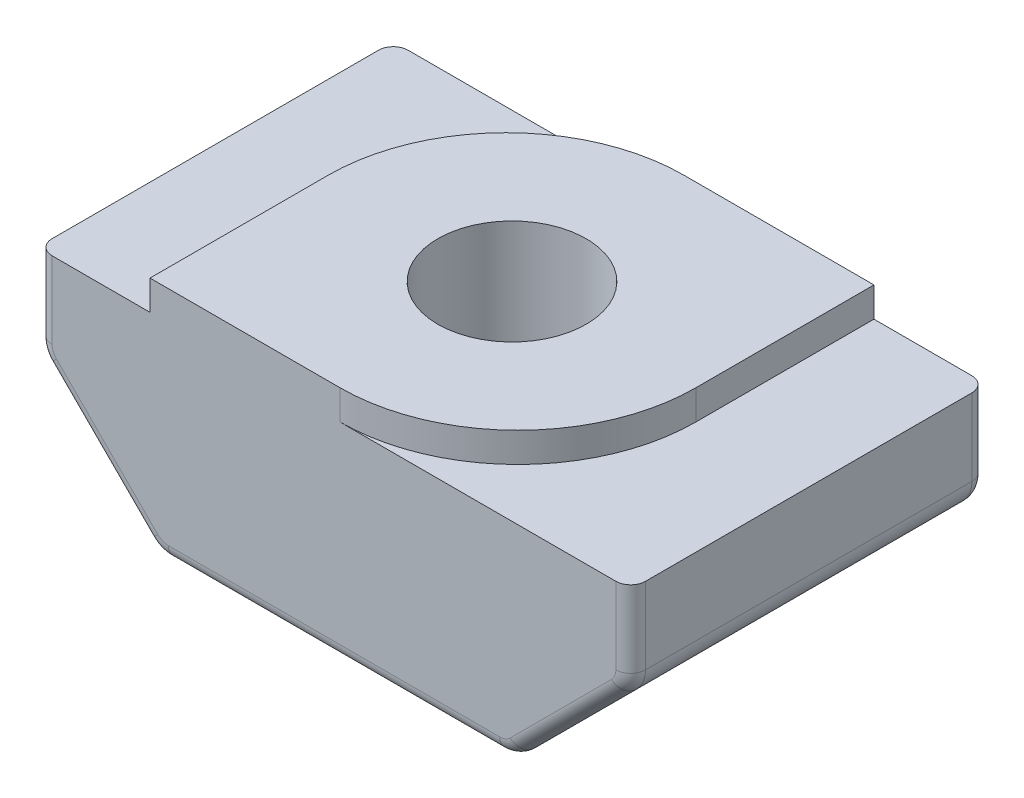
ISO-10303-21;
HEADER;
FILE_DESCRIPTION(('STEP AP214'),'2;1');
FILE_NAME('part.step','',(''),(''),'','','');
FILE_SCHEMA(('AUTOMOTIVE_DESIGN { 1 0 10303 214 1 1 1 1 }'));
ENDSEC;
DATA;
#1=APPLICATION_CONTEXT('core data for automotive mechanical design processes');
#2=APPLICATION_PROTOCOL_DEFINITION('international standard','automotive_design',2000,#1);
#3=PRODUCT_CONTEXT('',#1,'mechanical');
#4=PRODUCT('Part','Part','',(#3));
#5=PRODUCT_RELATED_PRODUCT_CATEGORY('part','',(#4));
#6=PRODUCT_DEFINITION_FORMATION('','',#4);
#7=PRODUCT_DEFINITION_CONTEXT('part definition',#1,'design');
#8=PRODUCT_DEFINITION('design','',#6,#7);
#9=PRODUCT_DEFINITION_SHAPE('','',#8);
#10=(LENGTH_UNIT() NAMED_UNIT(*) SI_UNIT(.MILLI.,.METRE.));
#11=(NAMED_UNIT(*) PLANE_ANGLE_UNIT() SI_UNIT($,.RADIAN.));
#12=(NAMED_UNIT(*) SI_UNIT($,.STERADIAN.) SOLID_ANGLE_UNIT());
#13=UNCERTAINTY_MEASURE_WITH_UNIT(LENGTH_MEASURE(1.E-05),#10,'distance_accuracy_value','');
#14=(GEOMETRIC_REPRESENTATION_CONTEXT(3) GLOBAL_UNCERTAINTY_ASSIGNED_CONTEXT((#13)) GLOBAL_UNIT_ASSIGNED_CONTEXT((#10,
#11,#12)) REPRESENTATION_CONTEXT('',''));
#15=CARTESIAN_POINT('',(0.,0.,0.));
#16=DIRECTION('',(0.,0.,1.));
#17=DIRECTION('',(1.,0.,0.));
#18=AXIS2_PLACEMENT_3D('',#15,#16,#17);
#19=CARTESIAN_POINT('',(-3.1,0.,6.));
#20=DIRECTION('',(1.,0.,0.));
#21=DIRECTION('',(0.,0.,-1.));
#22=AXIS2_PLACEMENT_3D('',#19,#20,#21);
#23=PLANE('',#22);
#24=DIRECTION('',(0.,0.,-1.));
#25=VECTOR('',#24,1.);
#26=CARTESIAN_POINT('',(-3.1,0.,6.));
#27=LINE('',#26,#25);
#28=CARTESIAN_POINT('',(-3.1,0.,6.));
#29=VERTEX_POINT('',#28);
#30=CARTESIAN_POINT('',(-3.1,0.,3.));
#31=VERTEX_POINT('',#30);
#32=EDGE_CURVE('E426',#29,#31,#27,.T.);
#33=ORIENTED_EDGE('',*,*,#32,.T.);
#34=DIRECTION('',(0.,-1.,0.));
#35=VECTOR('',#34,1.);
#36=CARTESIAN_POINT('',(-3.1,-0.500000000000001,3.));
#37=LINE('',#36,#35);
#38=CARTESIAN_POINT('',(-3.1,-0.500000000000001,3.));
#39=VERTEX_POINT('',#38);
#40=EDGE_CURVE('E238',#31,#39,#37,.T.);
#41=ORIENTED_EDGE('',*,*,#40,.T.);
#42=DIRECTION('',(0.,0.,-1.));
#43=VECTOR('',#42,1.);
#44=CARTESIAN_POINT('',(-3.1,-0.500000000000001,6.));
#45=LINE('',#44,#43);
#46=CARTESIAN_POINT('',(-3.1,-0.500000000000001,6.));
#47=VERTEX_POINT('',#46);
#48=EDGE_CURVE('E219',#47,#39,#45,.T.);
#49=ORIENTED_EDGE('',*,*,#48,.F.);
#50=DIRECTION('',(0.,-1.,0.));
#51=VECTOR('',#50,1.);
#52=CARTESIAN_POINT('',(-3.1,0.,6.));
#53=LINE('',#52,#51);
#54=EDGE_CURVE('E224',#29,#47,#53,.T.);
#55=ORIENTED_EDGE('',*,*,#54,.F.);
#56=EDGE_LOOP('',(#33,#41,#49,#55));
#57=FACE_BOUND('',#56,.T.);
#58=ADVANCED_FACE('F37',(#57),#23,.F.);
#59=CARTESIAN_POINT('',(-3.1,-0.500000000000001,6.));
#60=DIRECTION('',(0.,-1.,0.));
#61=DIRECTION('',(1.,0.,0.));
#62=AXIS2_PLACEMENT_3D('',#59,#60,#61);
#63=PLANE('',#62);
#64=DIRECTION('',(-1.,0.,0.));
#65=VECTOR('',#64,1.);
#66=CARTESIAN_POINT('',(-3.1,-0.500000000000001,0.));
#67=LINE('',#66,#65);
#68=CARTESIAN_POINT('',(-0.0999999999999998,-0.500000000000001,0.));
#69=VERTEX_POINT('',#68);
#70=CARTESIAN_POINT('',(-4.75,-0.500000000000001,0.));
#71=VERTEX_POINT('',#70);
#72=EDGE_CURVE('E429',#69,#71,#67,.T.);
#73=ORIENTED_EDGE('',*,*,#72,.T.);
#74=CARTESIAN_POINT('',(-4.75,-0.500000000000001,0.25));
#75=DIRECTION('',(0.,-1.,0.));
#76=DIRECTION('',(1.,0.,0.));
#77=AXIS2_PLACEMENT_3D('',#74,#75,#76);
#78=CIRCLE('',#77,0.25);
#79=CARTESIAN_POINT('',(-5.,-0.500000000000001,0.25));
#80=VERTEX_POINT('',#79);
#81=EDGE_CURVE('E310',#71,#80,#78,.F.);
#82=ORIENTED_EDGE('',*,*,#81,.T.);
#83=DIRECTION('',(0.,0.,-1.));
#84=VECTOR('',#83,1.);
#85=CARTESIAN_POINT('',(-5.,-0.500000000000001,6.));
#86=LINE('',#85,#84);
#87=CARTESIAN_POINT('',(-5.,-0.500000000000001,5.75));
#88=VERTEX_POINT('',#87);
#89=EDGE_CURVE('E239',#88,#80,#86,.T.);
#90=ORIENTED_EDGE('',*,*,#89,.F.);
#91=CARTESIAN_POINT('',(-4.75,-0.500000000000001,5.75));
#92=DIRECTION('',(0.,-1.,0.));
#93=DIRECTION('',(1.,0.,0.));
#94=AXIS2_PLACEMENT_3D('',#91,#92,#93);
#95=CIRCLE('',#94,0.25);
#96=CARTESIAN_POINT('',(-4.75,-0.500000000000001,6.));
#97=VERTEX_POINT('',#96);
#98=EDGE_CURVE('E222',#88,#97,#95,.F.);
#99=ORIENTED_EDGE('',*,*,#98,.T.);
#100=DIRECTION('',(-1.,0.,0.));
#101=VECTOR('',#100,1.);
#102=CARTESIAN_POINT('',(-3.1,-0.500000000000001,6.));
#103=LINE('',#102,#101);
#104=EDGE_CURVE('E213',#47,#97,#103,.T.);
#105=ORIENTED_EDGE('',*,*,#104,.F.);
#106=ORIENTED_EDGE('',*,*,#48,.T.);
#107=CARTESIAN_POINT('',(-0.0999999999999998,-0.500000000000001,3.));
#108=DIRECTION('',(0.,-1.,0.));
#109=DIRECTION('',(1.,0.,0.));
#110=AXIS2_PLACEMENT_3D('',#107,#108,#109);
#111=CIRCLE('',#110,3.);
#112=EDGE_CURVE('E257',#39,#69,#111,.T.);
#113=ORIENTED_EDGE('',*,*,#112,.T.);
#114=EDGE_LOOP('',(#73,#82,#90,#99,#105,#106,#113));
#115=FACE_BOUND('',#114,.T.);
#116=ADVANCED_FACE('F216',(#115),#63,.F.);
#117=CARTESIAN_POINT('',(-5.,-0.500000000000001,6.));
#118=DIRECTION('',(1.,0.,0.));
#119=DIRECTION('',(0.,0.,-1.));
#120=AXIS2_PLACEMENT_3D('',#117,#118,#119);
#121=PLANE('',#120);
#122=ORIENTED_EDGE('',*,*,#89,.T.);
#123=DIRECTION('',(0.,-1.,0.));
#124=VECTOR('',#123,1.);
#125=CARTESIAN_POINT('',(-5.,-1.79289321881345,0.25));
#126=LINE('',#125,#124);
#127=CARTESIAN_POINT('',(-5.,-1.79289321881345,0.25));
#128=VERTEX_POINT('',#127);
#129=EDGE_CURVE('E288',#80,#128,#126,.T.);
#130=ORIENTED_EDGE('',*,*,#129,.T.);
#131=DIRECTION('',(0.,0.,-1.));
#132=VECTOR('',#131,1.);
#133=CARTESIAN_POINT('',(-5.,-1.79289321881345,6.));
#134=LINE('',#133,#132);
#135=CARTESIAN_POINT('',(-5.,-1.79289321881345,5.75));
#136=VERTEX_POINT('',#135);
#137=EDGE_CURVE('E283',#128,#136,#134,.F.);
#138=ORIENTED_EDGE('',*,*,#137,.T.);
#139=DIRECTION('',(0.,-1.,0.));
#140=VECTOR('',#139,1.);
#141=CARTESIAN_POINT('',(-5.,-0.500000000000001,5.75));
#142=LINE('',#141,#140);
#143=EDGE_CURVE('E286',#136,#88,#142,.F.);
#144=ORIENTED_EDGE('',*,*,#143,.T.);
#145=EDGE_LOOP('',(#122,#130,#138,#144));
#146=FACE_BOUND('',#145,.T.);
#147=ADVANCED_FACE('F479',(#146),#121,.F.);
#148=CARTESIAN_POINT('',(-5.,-2.,6.));
#149=DIRECTION('',(0.707106781186546,0.707106781186549,0.));
#150=DIRECTION('',(-0.707106781186549,0.707106781186546,0.));
#151=AXIS2_PLACEMENT_3D('',#148,#149,#150);
#152=PLANE('',#151);
#153=DIRECTION('',(0.,0.,-1.));
#154=VECTOR('',#153,1.);
#155=CARTESIAN_POINT('',(-4.85355339059327,-2.14644660940673,6.));
#156=LINE('',#155,#154);
#157=CARTESIAN_POINT('',(-4.85355339059327,-2.14644660940673,5.75));
#158=VERTEX_POINT('',#157);
#159=CARTESIAN_POINT('',(-4.85355339059327,-2.14644660940673,0.25));
#160=VERTEX_POINT('',#159);
#161=EDGE_CURVE('E280',#158,#160,#156,.T.);
#162=ORIENTED_EDGE('',*,*,#161,.T.);
#163=DIRECTION('',(0.707106781186549,-0.707106781186546,0.));
#164=VECTOR('',#163,1.);
#165=CARTESIAN_POINT('',(-3.14644660940672,-3.85355339059328,0.25));
#166=LINE('',#165,#164);
#167=CARTESIAN_POINT('',(-3.14644660940672,-3.85355339059328,0.25));
#168=VERTEX_POINT('',#167);
#169=EDGE_CURVE('E318',#160,#168,#166,.T.);
#170=ORIENTED_EDGE('',*,*,#169,.T.);
#171=DIRECTION('',(0.,0.,-1.));
#172=VECTOR('',#171,1.);
#173=CARTESIAN_POINT('',(-3.14644660940672,-3.85355339059328,6.));
#174=LINE('',#173,#172);
#175=CARTESIAN_POINT('',(-3.14644660940672,-3.85355339059328,5.75));
#176=VERTEX_POINT('',#175);
#177=EDGE_CURVE('E277',#168,#176,#174,.F.);
#178=ORIENTED_EDGE('',*,*,#177,.T.);
#179=DIRECTION('',(0.707106781186549,-0.707106781186546,0.));
#180=VECTOR('',#179,1.);
#181=CARTESIAN_POINT('',(-5.,-2.,5.75));
#182=LINE('',#181,#180);
#183=EDGE_CURVE('E316',#176,#158,#182,.F.);
#184=ORIENTED_EDGE('',*,*,#183,.T.);
#185=EDGE_LOOP('',(#162,#170,#178,#184));
#186=FACE_BOUND('',#185,.T.);
#187=ADVANCED_FACE('F796',(#186),#152,.F.);
#188=CARTESIAN_POINT('',(-2.99999999999999,-4.,6.));
#189=DIRECTION('',(0.,1.,0.));
#190=DIRECTION('',(0.,0.,1.));
#191=AXIS2_PLACEMENT_3D('',#188,#189,#190);
#192=PLANE('',#191);
#193=CARTESIAN_POINT('',(0.,-4.,3.));
#194=DIRECTION('',(0.,1.,0.));
#195=DIRECTION('',(0.,0.,1.));
#196=AXIS2_PLACEMENT_3D('',#193,#194,#195);
#197=CIRCLE('',#196,1.25);
#198=CARTESIAN_POINT('',(0.,-4.,4.25));
#199=VERTEX_POINT('',#198);
#200=EDGE_CURVE('E432',#199,#199,#197,.T.);
#201=ORIENTED_EDGE('',*,*,#200,.T.);
#202=EDGE_LOOP('',(#201));
#203=FACE_BOUND('',#202,.T.);
#204=DIRECTION('',(0.,0.,-1.));
#205=VECTOR('',#204,1.);
#206=CARTESIAN_POINT('',(-2.79289321881344,-4.,6.));
#207=LINE('',#206,#205);
#208=CARTESIAN_POINT('',(-2.79289321881344,-4.,5.75));
#209=VERTEX_POINT('',#208);
#210=CARTESIAN_POINT('',(-2.79289321881344,-4.,0.25));
#211=VERTEX_POINT('',#210);
#212=EDGE_CURVE('E271',#209,#211,#207,.T.);
#213=ORIENTED_EDGE('',*,*,#212,.T.);
#214=DIRECTION('',(1.,0.,0.));
#215=VECTOR('',#214,1.);
#216=CARTESIAN_POINT('',(2.79289321881344,-4.,0.25));
#217=LINE('',#216,#215);
#218=CARTESIAN_POINT('',(2.79289321881344,-4.,0.25));
#219=VERTEX_POINT('',#218);
#220=EDGE_CURVE('E11',#211,#219,#217,.T.);
#221=ORIENTED_EDGE('',*,*,#220,.T.);
#222=DIRECTION('',(0.,0.,-1.));
#223=VECTOR('',#222,1.);
#224=CARTESIAN_POINT('',(2.79289321881344,-4.,6.));
#225=LINE('',#224,#223);
#226=CARTESIAN_POINT('',(2.79289321881344,-4.,5.75));
#227=VERTEX_POINT('',#226);
#228=EDGE_CURVE('E274',#219,#227,#225,.F.);
#229=ORIENTED_EDGE('',*,*,#228,.T.);
#230=DIRECTION('',(1.,0.,0.));
#231=VECTOR('',#230,1.);
#232=CARTESIAN_POINT('',(-2.99999999999999,-4.,5.75));
#233=LINE('',#232,#231);
#234=EDGE_CURVE('E46',#227,#209,#233,.F.);
#235=ORIENTED_EDGE('',*,*,#234,.T.);
#236=EDGE_LOOP('',(#213,#221,#229,#235));
#237=FACE_BOUND('',#236,.T.);
#238=ADVANCED_FACE('F787',(#203,#237),#192,.F.);
#239=CARTESIAN_POINT('',(5.,-2.,6.));
#240=DIRECTION('',(-0.707106781186546,0.707106781186549,0.));
#241=DIRECTION('',(-0.707106781186549,-0.707106781186546,0.));
#242=AXIS2_PLACEMENT_3D('',#239,#240,#241);
#243=PLANE('',#242);
#244=DIRECTION('',(0.,0.,-1.));
#245=VECTOR('',#244,1.);
#246=CARTESIAN_POINT('',(3.14644660940672,-3.85355339059328,6.));
#247=LINE('',#246,#245);
#248=CARTESIAN_POINT('',(3.14644660940672,-3.85355339059328,5.75));
#249=VERTEX_POINT('',#248);
#250=CARTESIAN_POINT('',(3.14644660940672,-3.85355339059328,0.25));
#251=VERTEX_POINT('',#250);
#252=EDGE_CURVE('E265',#249,#251,#247,.T.);
#253=ORIENTED_EDGE('',*,*,#252,.T.);
#254=DIRECTION('',(0.707106781186549,0.707106781186546,0.));
#255=VECTOR('',#254,1.);
#256=CARTESIAN_POINT('',(4.85355339059327,-2.14644660940673,0.25));
#257=LINE('',#256,#255);
#258=CARTESIAN_POINT('',(4.85355339059327,-2.14644660940673,0.25));
#259=VERTEX_POINT('',#258);
#260=EDGE_CURVE('E338',#251,#259,#257,.T.);
#261=ORIENTED_EDGE('',*,*,#260,.T.);
#262=DIRECTION('',(0.,0.,-1.));
#263=VECTOR('',#262,1.);
#264=CARTESIAN_POINT('',(4.85355339059327,-2.14644660940673,6.));
#265=LINE('',#264,#263);
#266=CARTESIAN_POINT('',(4.85355339059327,-2.14644660940673,5.75));
#267=VERTEX_POINT('',#266);
#268=EDGE_CURVE('E268',#259,#267,#265,.F.);
#269=ORIENTED_EDGE('',*,*,#268,.T.);
#270=DIRECTION('',(0.707106781186549,0.707106781186546,0.));
#271=VECTOR('',#270,1.);
#272=CARTESIAN_POINT('',(5.,-2.,5.75));
#273=LINE('',#272,#271);
#274=EDGE_CURVE('E336',#267,#249,#273,.F.);
#275=ORIENTED_EDGE('',*,*,#274,.T.);
#276=EDGE_LOOP('',(#253,#261,#269,#275));
#277=FACE_BOUND('',#276,.T.);
#278=ADVANCED_FACE('F779',(#277),#243,.F.);
#279=CARTESIAN_POINT('',(5.,-0.500000000000001,6.));
#280=DIRECTION('',(-1.,0.,0.));
#281=DIRECTION('',(0.,0.,1.));
#282=AXIS2_PLACEMENT_3D('',#279,#280,#281);
#283=PLANE('',#282);
#284=DIRECTION('',(0.,0.,-1.));
#285=VECTOR('',#284,1.);
#286=CARTESIAN_POINT('',(5.,-1.79289321881345,6.));
#287=LINE('',#286,#285);
#288=CARTESIAN_POINT('',(5.,-1.79289321881345,5.75));
#289=VERTEX_POINT('',#288);
#290=CARTESIAN_POINT('',(5.,-1.79289321881345,0.25));
#291=VERTEX_POINT('',#290);
#292=EDGE_CURVE('E262',#289,#291,#287,.T.);
#293=ORIENTED_EDGE('',*,*,#292,.T.);
#294=DIRECTION('',(0.,1.,0.));
#295=VECTOR('',#294,1.);
#296=CARTESIAN_POINT('',(5.,-0.500000000000001,0.25));
#297=LINE('',#296,#295);
#298=CARTESIAN_POINT('',(5.,-0.500000000000001,0.25));
#299=VERTEX_POINT('',#298);
#300=EDGE_CURVE('E326',#291,#299,#297,.T.);
#301=ORIENTED_EDGE('',*,*,#300,.T.);
#302=DIRECTION('',(0.,0.,-1.));
#303=VECTOR('',#302,1.);
#304=CARTESIAN_POINT('',(5.,-0.500000000000001,6.));
#305=LINE('',#304,#303);
#306=CARTESIAN_POINT('',(5.,-0.500000000000001,5.75));
#307=VERTEX_POINT('',#306);
#308=EDGE_CURVE('E244',#307,#299,#305,.T.);
#309=ORIENTED_EDGE('',*,*,#308,.F.);
#310=DIRECTION('',(0.,1.,0.));
#311=VECTOR('',#310,1.);
#312=CARTESIAN_POINT('',(5.,-0.500000000000001,5.75));
#313=LINE('',#312,#311);
#314=EDGE_CURVE('E324',#307,#289,#313,.F.);
#315=ORIENTED_EDGE('',*,*,#314,.T.);
#316=EDGE_LOOP('',(#293,#301,#309,#315));
#317=FACE_BOUND('',#316,.T.);
#318=ADVANCED_FACE('F771',(#317),#283,.F.);
#319=CARTESIAN_POINT('',(3.1,-0.500000000000001,6.));
#320=DIRECTION('',(0.,-1.,0.));
#321=DIRECTION('',(1.,0.,0.));
#322=AXIS2_PLACEMENT_3D('',#319,#320,#321);
#323=PLANE('',#322);
#324=ORIENTED_EDGE('',*,*,#308,.T.);
#325=CARTESIAN_POINT('',(4.75,-0.500000000000001,0.25));
#326=DIRECTION('',(0.,-1.,0.));
#327=DIRECTION('',(1.,0.,0.));
#328=AXIS2_PLACEMENT_3D('',#325,#326,#327);
#329=CIRCLE('',#328,0.25);
#330=CARTESIAN_POINT('',(4.75,-0.500000000000001,0.));
#331=VERTEX_POINT('',#330);
#332=EDGE_CURVE('E330',#299,#331,#329,.F.);
#333=ORIENTED_EDGE('',*,*,#332,.T.);
#334=DIRECTION('',(-1.,0.,0.));
#335=VECTOR('',#334,1.);
#336=CARTESIAN_POINT('',(3.1,-0.500000000000001,0.));
#337=LINE('',#336,#335);
#338=CARTESIAN_POINT('',(3.1,-0.500000000000001,0.));
#339=VERTEX_POINT('',#338);
#340=EDGE_CURVE('E431',#331,#339,#337,.T.);
#341=ORIENTED_EDGE('',*,*,#340,.T.);
#342=DIRECTION('',(0.,0.,-1.));
#343=VECTOR('',#342,1.);
#344=CARTESIAN_POINT('',(3.1,-0.500000000000001,6.));
#345=LINE('',#344,#343);
#346=CARTESIAN_POINT('',(3.1,-0.500000000000001,3.));
#347=VERTEX_POINT('',#346);
#348=EDGE_CURVE('E442',#347,#339,#345,.T.);
#349=ORIENTED_EDGE('',*,*,#348,.F.);
#350=CARTESIAN_POINT('',(0.0999999999999998,-0.500000000000001,3.));
#351=DIRECTION('',(0.,-1.,0.));
#352=DIRECTION('',(1.,0.,0.));
#353=AXIS2_PLACEMENT_3D('',#350,#351,#352);
#354=CIRCLE('',#353,3.);
#355=CARTESIAN_POINT('',(0.0999999999999998,-0.500000000000001,6.));
#356=VERTEX_POINT('',#355);
#357=EDGE_CURVE('E259',#347,#356,#354,.T.);
#358=ORIENTED_EDGE('',*,*,#357,.T.);
#359=DIRECTION('',(-1.,0.,0.));
#360=VECTOR('',#359,1.);
#361=CARTESIAN_POINT('',(3.1,-0.500000000000001,6.));
#362=LINE('',#361,#360);
#363=CARTESIAN_POINT('',(4.75,-0.500000000000001,6.));
#364=VERTEX_POINT('',#363);
#365=EDGE_CURVE('E223',#364,#356,#362,.T.);
#366=ORIENTED_EDGE('',*,*,#365,.F.);
#367=CARTESIAN_POINT('',(4.75,-0.500000000000001,5.75));
#368=DIRECTION('',(0.,-1.,0.));
#369=DIRECTION('',(1.,0.,0.));
#370=AXIS2_PLACEMENT_3D('',#367,#368,#369);
#371=CIRCLE('',#370,0.25);
#372=EDGE_CURVE('E328',#364,#307,#371,.F.);
#373=ORIENTED_EDGE('',*,*,#372,.T.);
#374=EDGE_LOOP('',(#324,#333,#341,#349,#358,#366,#373));
#375=FACE_BOUND('',#374,.T.);
#376=ADVANCED_FACE('F420',(#375),#323,.F.);
#377=CARTESIAN_POINT('',(3.1,0.,6.));
#378=DIRECTION('',(-1.,0.,0.));
#379=DIRECTION('',(0.,0.,1.));
#380=AXIS2_PLACEMENT_3D('',#377,#378,#379);
#381=PLANE('',#380);
#382=DIRECTION('',(0.,0.,-1.));
#383=VECTOR('',#382,1.);
#384=CARTESIAN_POINT('',(3.1,0.,6.));
#385=LINE('',#384,#383);
#386=CARTESIAN_POINT('',(3.1,0.,3.));
#387=VERTEX_POINT('',#386);
#388=CARTESIAN_POINT('',(3.1,0.,0.));
#389=VERTEX_POINT('',#388);
#390=EDGE_CURVE('E440',#387,#389,#385,.T.);
#391=ORIENTED_EDGE('',*,*,#390,.F.);
#392=DIRECTION('',(0.,1.,0.));
#393=VECTOR('',#392,1.);
#394=CARTESIAN_POINT('',(3.1,0.,3.));
#395=LINE('',#394,#393);
#396=EDGE_CURVE('E255',#387,#347,#395,.F.);
#397=ORIENTED_EDGE('',*,*,#396,.T.);
#398=ORIENTED_EDGE('',*,*,#348,.T.);
#399=DIRECTION('',(0.,1.,0.));
#400=VECTOR('',#399,1.);
#401=CARTESIAN_POINT('',(3.1,0.,0.));
#402=LINE('',#401,#400);
#403=EDGE_CURVE('E434',#339,#389,#402,.T.);
#404=ORIENTED_EDGE('',*,*,#403,.T.);
#405=EDGE_LOOP('',(#391,#397,#398,#404));
#406=FACE_BOUND('',#405,.T.);
#407=ADVANCED_FACE('F460',(#406),#381,.F.);
#408=CARTESIAN_POINT('',(3.1,0.,6.));
#409=DIRECTION('',(0.,-1.,0.));
#410=DIRECTION('',(1.,0.,0.));
#411=AXIS2_PLACEMENT_3D('',#408,#409,#410);
#412=PLANE('',#411);
#413=CARTESIAN_POINT('',(0.,0.,3.));
#414=DIRECTION('',(0.,1.,0.));
#415=DIRECTION('',(0.,0.,1.));
#416=AXIS2_PLACEMENT_3D('',#413,#414,#415);
#417=CIRCLE('',#416,1.24999999999999);
#418=CARTESIAN_POINT('',(0.,0.,4.24999999999999));
#419=VERTEX_POINT('',#418);
#420=EDGE_CURVE('E385',#419,#419,#417,.T.);
#421=ORIENTED_EDGE('',*,*,#420,.F.);
#422=EDGE_LOOP('',(#421));
#423=FACE_BOUND('',#422,.T.);
#424=DIRECTION('',(-1.,0.,0.));
#425=VECTOR('',#424,1.);
#426=CARTESIAN_POINT('',(3.1,0.,0.));
#427=LINE('',#426,#425);
#428=CARTESIAN_POINT('',(-0.099999999999999,0.,0.));
#429=VERTEX_POINT('',#428);
#430=EDGE_CURVE('E234',#389,#429,#427,.T.);
#431=ORIENTED_EDGE('',*,*,#430,.T.);
#432=CARTESIAN_POINT('',(-0.0999999999999998,0.,3.));
#433=DIRECTION('',(0.,-1.,0.));
#434=DIRECTION('',(1.,0.,0.));
#435=AXIS2_PLACEMENT_3D('',#432,#433,#434);
#436=CIRCLE('',#435,3.);
#437=EDGE_CURVE('E251',#429,#31,#436,.F.);
#438=ORIENTED_EDGE('',*,*,#437,.T.);
#439=ORIENTED_EDGE('',*,*,#32,.F.);
#440=DIRECTION('',(-1.,0.,0.));
#441=VECTOR('',#440,1.);
#442=CARTESIAN_POINT('',(3.1,0.,6.));
#443=LINE('',#442,#441);
#444=CARTESIAN_POINT('',(0.100000000000001,0.,6.));
#445=VERTEX_POINT('',#444);
#446=EDGE_CURVE('E230',#445,#29,#443,.T.);
#447=ORIENTED_EDGE('',*,*,#446,.F.);
#448=CARTESIAN_POINT('',(0.0999999999999998,0.,3.));
#449=DIRECTION('',(0.,-1.,0.));
#450=DIRECTION('',(1.,0.,0.));
#451=AXIS2_PLACEMENT_3D('',#448,#449,#450);
#452=CIRCLE('',#451,3.);
#453=EDGE_CURVE('E249',#445,#387,#452,.F.);
#454=ORIENTED_EDGE('',*,*,#453,.T.);
#455=ORIENTED_EDGE('',*,*,#390,.T.);
#456=EDGE_LOOP('',(#431,#438,#439,#447,#454,#455));
#457=FACE_BOUND('',#456,.T.);
#458=ADVANCED_FACE('F465',(#423,#457),#412,.F.);
#459=CARTESIAN_POINT('',(0.,0.,6.));
#460=DIRECTION('',(0.,0.,-1.));
#461=DIRECTION('',(-1.,0.,0.));
#462=AXIS2_PLACEMENT_3D('',#459,#460,#461);
#463=PLANE('',#462);
#464=ORIENTED_EDGE('',*,*,#104,.T.);
#465=DIRECTION('',(0.,-1.,0.));
#466=VECTOR('',#465,1.);
#467=CARTESIAN_POINT('',(-4.75,0.,6.));
#468=LINE('',#467,#466);
#469=CARTESIAN_POINT('',(-4.75,-1.79289321881345,6.));
#470=VERTEX_POINT('',#469);
#471=EDGE_CURVE('E359',#97,#470,#468,.T.);
#472=ORIENTED_EDGE('',*,*,#471,.T.);
#473=CARTESIAN_POINT('',(-4.5,-1.79289321881345,6.));
#474=DIRECTION('',(0.,0.,-1.));
#475=DIRECTION('',(-1.,0.,0.));
#476=AXIS2_PLACEMENT_3D('',#473,#474,#475);
#477=CIRCLE('',#476,0.25);
#478=CARTESIAN_POINT('',(-4.67677669529664,-1.96966991411009,6.));
#479=VERTEX_POINT('',#478);
#480=EDGE_CURVE('E61',#470,#479,#477,.F.);
#481=ORIENTED_EDGE('',*,*,#480,.T.);
#482=DIRECTION('',(0.707106781186549,-0.707106781186546,0.));
#483=VECTOR('',#482,1.);
#484=CARTESIAN_POINT('',(-3.32322330470335,-3.32322330470337,6.));
#485=LINE('',#484,#483);
#486=CARTESIAN_POINT('',(-2.96966991411008,-3.67677669529664,6.));
#487=VERTEX_POINT('',#486);
#488=EDGE_CURVE('E356',#479,#487,#485,.T.);
#489=ORIENTED_EDGE('',*,*,#488,.T.);
#490=CARTESIAN_POINT('',(-2.79289321881344,-3.5,6.));
#491=DIRECTION('',(0.,0.,-1.));
#492=DIRECTION('',(-1.,0.,0.));
#493=AXIS2_PLACEMENT_3D('',#490,#491,#492);
#494=CIRCLE('',#493,0.25);
#495=CARTESIAN_POINT('',(-2.79289321881344,-3.75,6.));
#496=VERTEX_POINT('',#495);
#497=EDGE_CURVE('E354',#487,#496,#494,.F.);
#498=ORIENTED_EDGE('',*,*,#497,.T.);
#499=DIRECTION('',(1.,0.,0.));
#500=VECTOR('',#499,1.);
#501=CARTESIAN_POINT('',(0.,-3.75,6.));
#502=LINE('',#501,#500);
#503=CARTESIAN_POINT('',(2.79289321881344,-3.75,6.));
#504=VERTEX_POINT('',#503);
#505=EDGE_CURVE('E344',#496,#504,#502,.T.);
#506=ORIENTED_EDGE('',*,*,#505,.T.);
#507=CARTESIAN_POINT('',(2.79289321881344,-3.5,6.));
#508=DIRECTION('',(0.,0.,-1.));
#509=DIRECTION('',(-1.,0.,0.));
#510=AXIS2_PLACEMENT_3D('',#507,#508,#509);
#511=CIRCLE('',#510,0.25);
#512=CARTESIAN_POINT('',(2.96966991411008,-3.67677669529664,6.));
#513=VERTEX_POINT('',#512);
#514=EDGE_CURVE('E346',#504,#513,#511,.F.);
#515=ORIENTED_EDGE('',*,*,#514,.T.);
#516=DIRECTION('',(0.707106781186549,0.707106781186546,0.));
#517=VECTOR('',#516,1.);
#518=CARTESIAN_POINT('',(3.32322330470335,-3.32322330470337,6.));
#519=LINE('',#518,#517);
#520=CARTESIAN_POINT('',(4.67677669529664,-1.96966991411009,6.));
#521=VERTEX_POINT('',#520);
#522=EDGE_CURVE('E348',#513,#521,#519,.T.);
#523=ORIENTED_EDGE('',*,*,#522,.T.);
#524=CARTESIAN_POINT('',(4.5,-1.79289321881345,6.));
#525=DIRECTION('',(0.,0.,-1.));
#526=DIRECTION('',(-1.,0.,0.));
#527=AXIS2_PLACEMENT_3D('',#524,#525,#526);
#528=CIRCLE('',#527,0.25);
#529=CARTESIAN_POINT('',(4.75,-1.79289321881345,6.));
#530=VERTEX_POINT('',#529);
#531=EDGE_CURVE('E350',#521,#530,#528,.F.);
#532=ORIENTED_EDGE('',*,*,#531,.T.);
#533=DIRECTION('',(0.,1.,0.));
#534=VECTOR('',#533,1.);
#535=CARTESIAN_POINT('',(4.75,0.,6.));
#536=LINE('',#535,#534);
#537=EDGE_CURVE('E352',#530,#364,#536,.T.);
#538=ORIENTED_EDGE('',*,*,#537,.T.);
#539=ORIENTED_EDGE('',*,*,#365,.T.);
#540=DIRECTION('',(0.,1.,0.));
#541=VECTOR('',#540,1.);
#542=CARTESIAN_POINT('',(0.0999999999999998,0.,6.));
#543=LINE('',#542,#541);
#544=EDGE_CURVE('E253',#356,#445,#543,.T.);
#545=ORIENTED_EDGE('',*,*,#544,.T.);
#546=ORIENTED_EDGE('',*,*,#446,.T.);
#547=ORIENTED_EDGE('',*,*,#54,.T.);
#548=EDGE_LOOP('',(#464,#472,#481,#489,#498,#506,#515,#523,#532,#538,#539,#545,#546,#547));
#549=FACE_BOUND('',#548,.T.);
#550=ADVANCED_FACE('F227',(#549),#463,.F.);
#551=CARTESIAN_POINT('',(0.,0.,0.));
#552=DIRECTION('',(0.,0.,-1.));
#553=DIRECTION('',(-1.,0.,0.));
#554=AXIS2_PLACEMENT_3D('',#551,#552,#553);
#555=PLANE('',#554);
#556=CARTESIAN_POINT('',(-4.5,-1.79289321881345,0.));
#557=DIRECTION('',(0.,0.,-1.));
#558=DIRECTION('',(-1.,0.,0.));
#559=AXIS2_PLACEMENT_3D('',#556,#557,#558);
#560=CIRCLE('',#559,0.25);
#561=CARTESIAN_POINT('',(-4.67677669529664,-1.96966991411009,0.));
#562=VERTEX_POINT('',#561);
#563=CARTESIAN_POINT('',(-4.75,-1.79289321881345,0.));
#564=VERTEX_POINT('',#563);
#565=EDGE_CURVE('E305',#562,#564,#560,.T.);
#566=ORIENTED_EDGE('',*,*,#565,.T.);
#567=DIRECTION('',(0.,-1.,0.));
#568=VECTOR('',#567,1.);
#569=CARTESIAN_POINT('',(-4.75,-0.500000000000001,0.));
#570=LINE('',#569,#568);
#571=EDGE_CURVE('E307',#564,#71,#570,.F.);
#572=ORIENTED_EDGE('',*,*,#571,.T.);
#573=ORIENTED_EDGE('',*,*,#72,.F.);
#574=DIRECTION('',(0.,-1.,0.));
#575=VECTOR('',#574,1.);
#576=CARTESIAN_POINT('',(-0.0999999999999998,0.,0.));
#577=LINE('',#576,#575);
#578=EDGE_CURVE('E241',#69,#429,#577,.F.);
#579=ORIENTED_EDGE('',*,*,#578,.T.);
#580=ORIENTED_EDGE('',*,*,#430,.F.);
#581=ORIENTED_EDGE('',*,*,#403,.F.);
#582=ORIENTED_EDGE('',*,*,#340,.F.);
#583=DIRECTION('',(0.,1.,0.));
#584=VECTOR('',#583,1.);
#585=CARTESIAN_POINT('',(4.75,-1.79289321881345,0.));
#586=LINE('',#585,#584);
#587=CARTESIAN_POINT('',(4.75,-1.79289321881345,0.));
#588=VERTEX_POINT('',#587);
#589=EDGE_CURVE('E299',#331,#588,#586,.F.);
#590=ORIENTED_EDGE('',*,*,#589,.T.);
#591=CARTESIAN_POINT('',(4.5,-1.79289321881345,0.));
#592=DIRECTION('',(0.,0.,-1.));
#593=DIRECTION('',(-1.,0.,0.));
#594=AXIS2_PLACEMENT_3D('',#591,#592,#593);
#595=CIRCLE('',#594,0.25);
#596=CARTESIAN_POINT('',(4.67677669529664,-1.96966991411009,0.));
#597=VERTEX_POINT('',#596);
#598=EDGE_CURVE('E297',#588,#597,#595,.T.);
#599=ORIENTED_EDGE('',*,*,#598,.T.);
#600=DIRECTION('',(0.707106781186549,0.707106781186546,0.));
#601=VECTOR('',#600,1.);
#602=CARTESIAN_POINT('',(2.96966991411008,-3.67677669529664,0.));
#603=LINE('',#602,#601);
#604=CARTESIAN_POINT('',(2.96966991411008,-3.67677669529664,0.));
#605=VERTEX_POINT('',#604);
#606=EDGE_CURVE('E295',#597,#605,#603,.F.);
#607=ORIENTED_EDGE('',*,*,#606,.T.);
#608=CARTESIAN_POINT('',(2.79289321881344,-3.5,0.));
#609=DIRECTION('',(0.,0.,-1.));
#610=DIRECTION('',(-1.,0.,0.));
#611=AXIS2_PLACEMENT_3D('',#608,#609,#610);
#612=CIRCLE('',#611,0.25);
#613=CARTESIAN_POINT('',(2.79289321881344,-3.75,0.));
#614=VERTEX_POINT('',#613);
#615=EDGE_CURVE('E293',#605,#614,#612,.T.);
#616=ORIENTED_EDGE('',*,*,#615,.T.);
#617=DIRECTION('',(1.,0.,0.));
#618=VECTOR('',#617,1.);
#619=CARTESIAN_POINT('',(-2.79289321881344,-3.75,0.));
#620=LINE('',#619,#618);
#621=CARTESIAN_POINT('',(-2.79289321881344,-3.75,0.));
#622=VERTEX_POINT('',#621);
#623=EDGE_CURVE('E291',#614,#622,#620,.F.);
#624=ORIENTED_EDGE('',*,*,#623,.T.);
#625=CARTESIAN_POINT('',(-2.79289321881344,-3.5,0.));
#626=DIRECTION('',(0.,0.,-1.));
#627=DIRECTION('',(-1.,0.,0.));
#628=AXIS2_PLACEMENT_3D('',#625,#626,#627);
#629=CIRCLE('',#628,0.25);
#630=CARTESIAN_POINT('',(-2.96966991411008,-3.67677669529664,0.));
#631=VERTEX_POINT('',#630);
#632=EDGE_CURVE('E301',#622,#631,#629,.T.);
#633=ORIENTED_EDGE('',*,*,#632,.T.);
#634=DIRECTION('',(0.707106781186549,-0.707106781186546,0.));
#635=VECTOR('',#634,1.);
#636=CARTESIAN_POINT('',(-4.67677669529664,-1.96966991411009,0.));
#637=LINE('',#636,#635);
#638=EDGE_CURVE('E303',#631,#562,#637,.F.);
#639=ORIENTED_EDGE('',*,*,#638,.T.);
#640=EDGE_LOOP('',(#566,#572,#573,#579,#580,#581,#582,#590,#599,#607,#616,#624,#633,#639));
#641=FACE_BOUND('',#640,.T.);
#642=ADVANCED_FACE('F454',(#641),#555,.T.);
#643=CARTESIAN_POINT('',(0.,0.,3.));
#644=DIRECTION('',(0.,1.,0.));
#645=DIRECTION('',(0.,0.,1.));
#646=AXIS2_PLACEMENT_3D('',#643,#644,#645);
#647=CYLINDRICAL_SURFACE('',#646,1.24999999999999);
#648=ORIENTED_EDGE('',*,*,#200,.F.);
#649=EDGE_LOOP('',(#648));
#650=FACE_BOUND('',#649,.T.);
#651=ORIENTED_EDGE('',*,*,#420,.T.);
#652=EDGE_LOOP('',(#651));
#653=FACE_BOUND('',#652,.T.);
#654=ADVANCED_FACE('F506',(#650,#653),#647,.F.);
#655=CARTESIAN_POINT('',(-0.0999999999999998,0.,3.));
#656=DIRECTION('',(0.,1.,0.));
#657=DIRECTION('',(0.,0.,1.));
#658=AXIS2_PLACEMENT_3D('',#655,#656,#657);
#659=CYLINDRICAL_SURFACE('',#658,3.);
#660=ORIENTED_EDGE('',*,*,#437,.F.);
#661=ORIENTED_EDGE('',*,*,#578,.F.);
#662=ORIENTED_EDGE('',*,*,#112,.F.);
#663=ORIENTED_EDGE('',*,*,#40,.F.);
#664=EDGE_LOOP('',(#660,#661,#662,#663));
#665=FACE_BOUND('',#664,.T.);
#666=ADVANCED_FACE('F468',(#665),#659,.T.);
#667=CARTESIAN_POINT('',(0.0999999999999998,0.,3.));
#668=DIRECTION('',(0.,1.,0.));
#669=DIRECTION('',(0.,0.,1.));
#670=AXIS2_PLACEMENT_3D('',#667,#668,#669);
#671=CYLINDRICAL_SURFACE('',#670,3.);
#672=ORIENTED_EDGE('',*,*,#357,.F.);
#673=ORIENTED_EDGE('',*,*,#396,.F.);
#674=ORIENTED_EDGE('',*,*,#453,.F.);
#675=ORIENTED_EDGE('',*,*,#544,.F.);
#676=EDGE_LOOP('',(#672,#673,#674,#675));
#677=FACE_BOUND('',#676,.T.);
#678=ADVANCED_FACE('F463',(#677),#671,.T.);
#679=CARTESIAN_POINT('',(4.5,-1.79289321881345,6.));
#680=DIRECTION('',(0.,0.,-1.));
#681=DIRECTION('',(-1.,0.,0.));
#682=AXIS2_PLACEMENT_3D('',#679,#680,#681);
#683=CYLINDRICAL_SURFACE('',#682,0.5);
#684=ORIENTED_EDGE('',*,*,#268,.F.);
#685=CARTESIAN_POINT('',(4.5,-1.79289321881345,0.25));
#686=DIRECTION('',(0.,0.,-1.));
#687=DIRECTION('',(-1.,0.,0.));
#688=AXIS2_PLACEMENT_3D('',#685,#686,#687);
#689=CIRCLE('',#688,0.5);
#690=EDGE_CURVE('E334',#259,#291,#689,.F.);
#691=ORIENTED_EDGE('',*,*,#690,.T.);
#692=ORIENTED_EDGE('',*,*,#292,.F.);
#693=CARTESIAN_POINT('',(4.5,-1.79289321881345,5.75));
#694=DIRECTION('',(0.,0.,-1.));
#695=DIRECTION('',(-1.,0.,0.));
#696=AXIS2_PLACEMENT_3D('',#693,#694,#695);
#697=CIRCLE('',#696,0.5);
#698=EDGE_CURVE('E332',#289,#267,#697,.T.);
#699=ORIENTED_EDGE('',*,*,#698,.T.);
#700=EDGE_LOOP('',(#684,#691,#692,#699));
#701=FACE_BOUND('',#700,.T.);
#702=ADVANCED_FACE('F509',(#701),#683,.T.);
#703=CARTESIAN_POINT('',(2.79289321881344,-3.5,6.));
#704=DIRECTION('',(0.,0.,-1.));
#705=DIRECTION('',(-1.,0.,0.));
#706=AXIS2_PLACEMENT_3D('',#703,#704,#705);
#707=CYLINDRICAL_SURFACE('',#706,0.5);
#708=ORIENTED_EDGE('',*,*,#228,.F.);
#709=CARTESIAN_POINT('',(2.79289321881344,-3.5,0.25));
#710=DIRECTION('',(0.,0.,-1.));
#711=DIRECTION('',(-1.,0.,0.));
#712=AXIS2_PLACEMENT_3D('',#709,#710,#711);
#713=CIRCLE('',#712,0.5);
#714=EDGE_CURVE('E342',#219,#251,#713,.F.);
#715=ORIENTED_EDGE('',*,*,#714,.T.);
#716=ORIENTED_EDGE('',*,*,#252,.F.);
#717=CARTESIAN_POINT('',(2.79289321881344,-3.5,5.75));
#718=DIRECTION('',(0.,0.,-1.));
#719=DIRECTION('',(-1.,0.,0.));
#720=AXIS2_PLACEMENT_3D('',#717,#718,#719);
#721=CIRCLE('',#720,0.5);
#722=EDGE_CURVE('E340',#249,#227,#721,.T.);
#723=ORIENTED_EDGE('',*,*,#722,.T.);
#724=EDGE_LOOP('',(#708,#715,#716,#723));
#725=FACE_BOUND('',#724,.T.);
#726=ADVANCED_FACE('F512',(#725),#707,.T.);
#727=CARTESIAN_POINT('',(-4.5,-1.79289321881345,6.));
#728=DIRECTION('',(0.,0.,-1.));
#729=DIRECTION('',(-1.,0.,0.));
#730=AXIS2_PLACEMENT_3D('',#727,#728,#729);
#731=CYLINDRICAL_SURFACE('',#730,0.5);
#732=ORIENTED_EDGE('',*,*,#137,.F.);
#733=CARTESIAN_POINT('',(-4.5,-1.79289321881345,0.25));
#734=DIRECTION('',(0.,0.,-1.));
#735=DIRECTION('',(-1.,0.,0.));
#736=AXIS2_PLACEMENT_3D('',#733,#734,#735);
#737=CIRCLE('',#736,0.5);
#738=EDGE_CURVE('E314',#128,#160,#737,.F.);
#739=ORIENTED_EDGE('',*,*,#738,.T.);
#740=ORIENTED_EDGE('',*,*,#161,.F.);
#741=CARTESIAN_POINT('',(-4.5,-1.79289321881345,5.75));
#742=DIRECTION('',(0.,0.,-1.));
#743=DIRECTION('',(-1.,0.,0.));
#744=AXIS2_PLACEMENT_3D('',#741,#742,#743);
#745=CIRCLE('',#744,0.5);
#746=EDGE_CURVE('E312',#158,#136,#745,.T.);
#747=ORIENTED_EDGE('',*,*,#746,.T.);
#748=EDGE_LOOP('',(#732,#739,#740,#747));
#749=FACE_BOUND('',#748,.T.);
#750=ADVANCED_FACE('F481',(#749),#731,.T.);
#751=CARTESIAN_POINT('',(-2.79289321881344,-3.5,6.));
#752=DIRECTION('',(0.,0.,-1.));
#753=DIRECTION('',(-1.,0.,0.));
#754=AXIS2_PLACEMENT_3D('',#751,#752,#753);
#755=CYLINDRICAL_SURFACE('',#754,0.5);
#756=ORIENTED_EDGE('',*,*,#177,.F.);
#757=CARTESIAN_POINT('',(-2.79289321881344,-3.5,0.25));
#758=DIRECTION('',(0.,0.,-1.));
#759=DIRECTION('',(-1.,0.,0.));
#760=AXIS2_PLACEMENT_3D('',#757,#758,#759);
#761=CIRCLE('',#760,0.5);
#762=EDGE_CURVE('E322',#168,#211,#761,.F.);
#763=ORIENTED_EDGE('',*,*,#762,.T.);
#764=ORIENTED_EDGE('',*,*,#212,.F.);
#765=CARTESIAN_POINT('',(-2.79289321881344,-3.5,5.75));
#766=DIRECTION('',(0.,0.,-1.));
#767=DIRECTION('',(-1.,0.,0.));
#768=AXIS2_PLACEMENT_3D('',#765,#766,#767);
#769=CIRCLE('',#768,0.5);
#770=EDGE_CURVE('E320',#209,#176,#769,.T.);
#771=ORIENTED_EDGE('',*,*,#770,.T.);
#772=EDGE_LOOP('',(#756,#763,#764,#771));
#773=FACE_BOUND('',#772,.T.);
#774=ADVANCED_FACE('F519',(#773),#755,.T.);
#775=CARTESIAN_POINT('',(4.75,-0.500000000000001,0.25));
#776=DIRECTION('',(0.,-1.,0.));
#777=DIRECTION('',(0.,0.,-1.));
#778=AXIS2_PLACEMENT_3D('',#775,#776,#777);
#779=CYLINDRICAL_SURFACE('',#778,0.25);
#780=ORIENTED_EDGE('',*,*,#332,.F.);
#781=ORIENTED_EDGE('',*,*,#300,.F.);
#782=CARTESIAN_POINT('',(4.75,-1.79289321881345,0.25));
#783=DIRECTION('',(0.,-1.,0.));
#784=DIRECTION('',(0.,0.,-1.));
#785=AXIS2_PLACEMENT_3D('',#782,#783,#784);
#786=CIRCLE('',#785,0.25);
#787=EDGE_CURVE('E382',#588,#291,#786,.T.);
#788=ORIENTED_EDGE('',*,*,#787,.F.);
#789=ORIENTED_EDGE('',*,*,#589,.F.);
#790=EDGE_LOOP('',(#780,#781,#788,#789));
#791=FACE_BOUND('',#790,.T.);
#792=ADVANCED_FACE('F450',(#791),#779,.T.);
#793=CARTESIAN_POINT('',(4.5,-1.79289321881345,0.25));
#794=DIRECTION('',(0.,0.,-1.));
#795=DIRECTION('',(-1.,0.,0.));
#796=AXIS2_PLACEMENT_3D('',#793,#794,#795);
#797=DEGENERATE_TOROIDAL_SURFACE('',#796,0.25,0.25,.T.);
#798=ORIENTED_EDGE('',*,*,#787,.T.);
#799=ORIENTED_EDGE('',*,*,#690,.F.);
#800=CARTESIAN_POINT('',(4.67677669529664,-1.96966991411009,0.25));
#801=DIRECTION('',(-0.707106781186548,-0.707106781186548,0.));
#802=DIRECTION('',(0.707106781186548,-0.707106781186548,0.));
#803=AXIS2_PLACEMENT_3D('',#800,#801,#802);
#804=CIRCLE('',#803,0.25);
#805=EDGE_CURVE('E379',#597,#259,#804,.T.);
#806=ORIENTED_EDGE('',*,*,#805,.F.);
#807=ORIENTED_EDGE('',*,*,#598,.F.);
#808=EDGE_LOOP('',(#798,#799,#806,#807));
#809=FACE_BOUND('',#808,.T.);
#810=ADVANCED_FACE('F548',(#809),#797,.T.);
#811=CARTESIAN_POINT('',(4.82322330470336,-1.82322330470336,0.25));
#812=DIRECTION('',(-0.707106781186549,-0.707106781186546,0.));
#813=DIRECTION('',(0.707106781186546,-0.707106781186549,0.));
#814=AXIS2_PLACEMENT_3D('',#811,#812,#813);
#815=CYLINDRICAL_SURFACE('',#814,0.25);
#816=ORIENTED_EDGE('',*,*,#805,.T.);
#817=ORIENTED_EDGE('',*,*,#260,.F.);
#818=CARTESIAN_POINT('',(2.96966991411008,-3.67677669529664,0.25));
#819=DIRECTION('',(-0.707106781186548,-0.707106781186547,0.));
#820=DIRECTION('',(0.707106781186547,-0.707106781186548,0.));
#821=AXIS2_PLACEMENT_3D('',#818,#819,#820);
#822=CIRCLE('',#821,0.25);
#823=EDGE_CURVE('E376',#605,#251,#822,.T.);
#824=ORIENTED_EDGE('',*,*,#823,.F.);
#825=ORIENTED_EDGE('',*,*,#606,.F.);
#826=EDGE_LOOP('',(#816,#817,#824,#825));
#827=FACE_BOUND('',#826,.T.);
#828=ADVANCED_FACE('F544',(#827),#815,.T.);
#829=CARTESIAN_POINT('',(2.79289321881344,-3.5,0.25));
#830=DIRECTION('',(0.,0.,-1.));
#831=DIRECTION('',(-1.,0.,0.));
#832=AXIS2_PLACEMENT_3D('',#829,#830,#831);
#833=DEGENERATE_TOROIDAL_SURFACE('',#832,0.25,0.25,.T.);
#834=ORIENTED_EDGE('',*,*,#823,.T.);
#835=ORIENTED_EDGE('',*,*,#714,.F.);
#836=CARTESIAN_POINT('',(2.79289321881344,-3.75,0.25));
#837=DIRECTION('',(-1.,0.,0.));
#838=DIRECTION('',(0.,0.,1.));
#839=AXIS2_PLACEMENT_3D('',#836,#837,#838);
#840=CIRCLE('',#839,0.25);
#841=EDGE_CURVE('E373',#614,#219,#840,.T.);
#842=ORIENTED_EDGE('',*,*,#841,.F.);
#843=ORIENTED_EDGE('',*,*,#615,.F.);
#844=EDGE_LOOP('',(#834,#835,#842,#843));
#845=FACE_BOUND('',#844,.T.);
#846=ADVANCED_FACE('F540',(#845),#833,.T.);
#847=CARTESIAN_POINT('',(-2.99999999999999,-3.75,0.25));
#848=DIRECTION('',(-1.,0.,0.));
#849=DIRECTION('',(0.,0.,1.));
#850=AXIS2_PLACEMENT_3D('',#847,#848,#849);
#851=CYLINDRICAL_SURFACE('',#850,0.25);
#852=ORIENTED_EDGE('',*,*,#841,.T.);
#853=ORIENTED_EDGE('',*,*,#220,.F.);
#854=CARTESIAN_POINT('',(-2.79289321881344,-3.75,0.25));
#855=DIRECTION('',(-1.,0.,0.));
#856=DIRECTION('',(0.,0.,1.));
#857=AXIS2_PLACEMENT_3D('',#854,#855,#856);
#858=CIRCLE('',#857,0.25);
#859=EDGE_CURVE('E370',#622,#211,#858,.T.);
#860=ORIENTED_EDGE('',*,*,#859,.F.);
#861=ORIENTED_EDGE('',*,*,#623,.F.);
#862=EDGE_LOOP('',(#852,#853,#860,#861));
#863=FACE_BOUND('',#862,.T.);
#864=ADVANCED_FACE('F536',(#863),#851,.T.);
#865=CARTESIAN_POINT('',(-2.79289321881344,-3.5,0.25));
#866=DIRECTION('',(0.,0.,-1.));
#867=DIRECTION('',(-1.,0.,0.));
#868=AXIS2_PLACEMENT_3D('',#865,#866,#867);
#869=DEGENERATE_TOROIDAL_SURFACE('',#868,0.25,0.25,.T.);
#870=ORIENTED_EDGE('',*,*,#859,.T.);
#871=ORIENTED_EDGE('',*,*,#762,.F.);
#872=CARTESIAN_POINT('',(-2.96966991411008,-3.67677669529664,0.25));
#873=DIRECTION('',(-0.707106781186548,0.707106781186547,0.));
#874=DIRECTION('',(-0.707106781186547,-0.707106781186548,0.));
#875=AXIS2_PLACEMENT_3D('',#872,#873,#874);
#876=CIRCLE('',#875,0.25);
#877=EDGE_CURVE('E367',#631,#168,#876,.T.);
#878=ORIENTED_EDGE('',*,*,#877,.F.);
#879=ORIENTED_EDGE('',*,*,#632,.F.);
#880=EDGE_LOOP('',(#870,#871,#878,#879));
#881=FACE_BOUND('',#880,.T.);
#882=ADVANCED_FACE('F532',(#881),#869,.T.);
#883=CARTESIAN_POINT('',(-4.82322330470336,-1.82322330470336,0.25));
#884=DIRECTION('',(-0.707106781186549,0.707106781186546,0.));
#885=DIRECTION('',(-0.707106781186546,-0.707106781186549,0.));
#886=AXIS2_PLACEMENT_3D('',#883,#884,#885);
#887=CYLINDRICAL_SURFACE('',#886,0.25);
#888=ORIENTED_EDGE('',*,*,#877,.T.);
#889=ORIENTED_EDGE('',*,*,#169,.F.);
#890=CARTESIAN_POINT('',(-4.67677669529664,-1.96966991411009,0.25));
#891=DIRECTION('',(-0.707106781186548,0.707106781186548,0.));
#892=DIRECTION('',(-0.707106781186548,-0.707106781186548,0.));
#893=AXIS2_PLACEMENT_3D('',#890,#891,#892);
#894=CIRCLE('',#893,0.25);
#895=EDGE_CURVE('E364',#562,#160,#894,.T.);
#896=ORIENTED_EDGE('',*,*,#895,.F.);
#897=ORIENTED_EDGE('',*,*,#638,.F.);
#898=EDGE_LOOP('',(#888,#889,#896,#897));
#899=FACE_BOUND('',#898,.T.);
#900=ADVANCED_FACE('F528',(#899),#887,.T.);
#901=CARTESIAN_POINT('',(-4.5,-1.79289321881345,0.25));
#902=DIRECTION('',(0.,0.,-1.));
#903=DIRECTION('',(-1.,0.,0.));
#904=AXIS2_PLACEMENT_3D('',#901,#902,#903);
#905=DEGENERATE_TOROIDAL_SURFACE('',#904,0.25,0.25,.T.);
#906=ORIENTED_EDGE('',*,*,#895,.T.);
#907=ORIENTED_EDGE('',*,*,#738,.F.);
#908=CARTESIAN_POINT('',(-4.75,-1.79289321881345,0.25));
#909=DIRECTION('',(0.,1.,0.));
#910=DIRECTION('',(0.,0.,1.));
#911=AXIS2_PLACEMENT_3D('',#908,#909,#910);
#912=CIRCLE('',#911,0.25);
#913=EDGE_CURVE('E362',#564,#128,#912,.T.);
#914=ORIENTED_EDGE('',*,*,#913,.F.);
#915=ORIENTED_EDGE('',*,*,#565,.F.);
#916=EDGE_LOOP('',(#906,#907,#914,#915));
#917=FACE_BOUND('',#916,.T.);
#918=ADVANCED_FACE('F525',(#917),#905,.T.);
#919=CARTESIAN_POINT('',(-4.75,-0.500000000000001,0.25));
#920=DIRECTION('',(0.,1.,0.));
#921=DIRECTION('',(0.,0.,1.));
#922=AXIS2_PLACEMENT_3D('',#919,#920,#921);
#923=CYLINDRICAL_SURFACE('',#922,0.25);
#924=ORIENTED_EDGE('',*,*,#81,.F.);
#925=ORIENTED_EDGE('',*,*,#571,.F.);
#926=ORIENTED_EDGE('',*,*,#913,.T.);
#927=ORIENTED_EDGE('',*,*,#129,.F.);
#928=EDGE_LOOP('',(#924,#925,#926,#927));
#929=FACE_BOUND('',#928,.T.);
#930=ADVANCED_FACE('F474',(#929),#923,.T.);
#931=CARTESIAN_POINT('',(4.75,0.,5.75));
#932=DIRECTION('',(0.,1.,0.));
#933=DIRECTION('',(0.,0.,1.));
#934=AXIS2_PLACEMENT_3D('',#931,#932,#933);
#935=CYLINDRICAL_SURFACE('',#934,0.25);
#936=ORIENTED_EDGE('',*,*,#372,.F.);
#937=ORIENTED_EDGE('',*,*,#537,.F.);
#938=CARTESIAN_POINT('',(4.75,-1.79289321881345,5.75));
#939=DIRECTION('',(0.,-1.,0.));
#940=DIRECTION('',(0.,0.,-1.));
#941=AXIS2_PLACEMENT_3D('',#938,#939,#940);
#942=CIRCLE('',#941,0.25);
#943=EDGE_CURVE('E41',#289,#530,#942,.T.);
#944=ORIENTED_EDGE('',*,*,#943,.F.);
#945=ORIENTED_EDGE('',*,*,#314,.F.);
#946=EDGE_LOOP('',(#936,#937,#944,#945));
#947=FACE_BOUND('',#946,.T.);
#948=ADVANCED_FACE('F39',(#947),#935,.T.);
#949=CARTESIAN_POINT('',(4.5,-1.79289321881345,5.75));
#950=DIRECTION('',(0.,0.,-1.));
#951=DIRECTION('',(-1.,0.,0.));
#952=AXIS2_PLACEMENT_3D('',#949,#950,#951);
#953=DEGENERATE_TOROIDAL_SURFACE('',#952,0.25,0.25,.T.);
#954=ORIENTED_EDGE('',*,*,#943,.T.);
#955=ORIENTED_EDGE('',*,*,#531,.F.);
#956=CARTESIAN_POINT('',(4.67677669529664,-1.96966991411009,5.75));
#957=DIRECTION('',(-0.707106781186549,-0.707106781186546,0.));
#958=DIRECTION('',(0.707106781186546,-0.707106781186549,0.));
#959=AXIS2_PLACEMENT_3D('',#956,#957,#958);
#960=CIRCLE('',#959,0.25);
#961=EDGE_CURVE('E401',#267,#521,#960,.T.);
#962=ORIENTED_EDGE('',*,*,#961,.F.);
#963=ORIENTED_EDGE('',*,*,#698,.F.);
#964=EDGE_LOOP('',(#954,#955,#962,#963));
#965=FACE_BOUND('',#964,.T.);
#966=ADVANCED_FACE('F412',(#965),#953,.T.);
#967=CARTESIAN_POINT('',(3.32322330470335,-3.32322330470337,5.75));
#968=DIRECTION('',(0.707106781186549,0.707106781186546,0.));
#969=DIRECTION('',(-0.707106781186546,0.707106781186549,0.));
#970=AXIS2_PLACEMENT_3D('',#967,#968,#969);
#971=CYLINDRICAL_SURFACE('',#970,0.25);
#972=ORIENTED_EDGE('',*,*,#961,.T.);
#973=ORIENTED_EDGE('',*,*,#522,.F.);
#974=CARTESIAN_POINT('',(2.96966991411008,-3.67677669529664,5.75));
#975=DIRECTION('',(-0.707106781186548,-0.707106781186547,0.));
#976=DIRECTION('',(0.707106781186547,-0.707106781186548,0.));
#977=AXIS2_PLACEMENT_3D('',#974,#975,#976);
#978=CIRCLE('',#977,0.25);
#979=EDGE_CURVE('E399',#249,#513,#978,.T.);
#980=ORIENTED_EDGE('',*,*,#979,.F.);
#981=ORIENTED_EDGE('',*,*,#274,.F.);
#982=EDGE_LOOP('',(#972,#973,#980,#981));
#983=FACE_BOUND('',#982,.T.);
#984=ADVANCED_FACE('F600',(#983),#971,.T.);
#985=CARTESIAN_POINT('',(2.79289321881344,-3.5,5.75));
#986=DIRECTION('',(0.,0.,-1.));
#987=DIRECTION('',(-1.,0.,0.));
#988=AXIS2_PLACEMENT_3D('',#985,#986,#987);
#989=DEGENERATE_TOROIDAL_SURFACE('',#988,0.25,0.25,.T.);
#990=ORIENTED_EDGE('',*,*,#979,.T.);
#991=ORIENTED_EDGE('',*,*,#514,.F.);
#992=CARTESIAN_POINT('',(2.79289321881344,-3.75,5.75));
#993=DIRECTION('',(-1.,0.,0.));
#994=DIRECTION('',(0.,0.,1.));
#995=AXIS2_PLACEMENT_3D('',#992,#993,#994);
#996=CIRCLE('',#995,0.25);
#997=EDGE_CURVE('E396',#227,#504,#996,.T.);
#998=ORIENTED_EDGE('',*,*,#997,.F.);
#999=ORIENTED_EDGE('',*,*,#722,.F.);
#1000=EDGE_LOOP('',(#990,#991,#998,#999));
#1001=FACE_BOUND('',#1000,.T.);
#1002=ADVANCED_FACE('F606',(#1001),#989,.T.);
#1003=CARTESIAN_POINT('',(0.,-3.75,5.75));
#1004=DIRECTION('',(1.,0.,0.));
#1005=DIRECTION('',(0.,0.,-1.));
#1006=AXIS2_PLACEMENT_3D('',#1003,#1004,#1005);
#1007=CYLINDRICAL_SURFACE('',#1006,0.25);
#1008=ORIENTED_EDGE('',*,*,#997,.T.);
#1009=ORIENTED_EDGE('',*,*,#505,.F.);
#1010=CARTESIAN_POINT('',(-2.79289321881344,-3.75,5.75));
#1011=DIRECTION('',(-1.,0.,0.));
#1012=DIRECTION('',(0.,0.,1.));
#1013=AXIS2_PLACEMENT_3D('',#1010,#1011,#1012);
#1014=CIRCLE('',#1013,0.25);
#1015=EDGE_CURVE('E393',#209,#496,#1014,.T.);
#1016=ORIENTED_EDGE('',*,*,#1015,.F.);
#1017=ORIENTED_EDGE('',*,*,#234,.F.);
#1018=EDGE_LOOP('',(#1008,#1009,#1016,#1017));
#1019=FACE_BOUND('',#1018,.T.);
#1020=ADVANCED_FACE('F613',(#1019),#1007,.T.);
#1021=CARTESIAN_POINT('',(-2.79289321881344,-3.5,5.75));
#1022=DIRECTION('',(0.,0.,-1.));
#1023=DIRECTION('',(-1.,0.,0.));
#1024=AXIS2_PLACEMENT_3D('',#1021,#1022,#1023);
#1025=DEGENERATE_TOROIDAL_SURFACE('',#1024,0.25,0.25,.T.);
#1026=ORIENTED_EDGE('',*,*,#1015,.T.);
#1027=ORIENTED_EDGE('',*,*,#497,.F.);
#1028=CARTESIAN_POINT('',(-2.96966991411008,-3.67677669529664,5.75));
#1029=DIRECTION('',(-0.707106781186548,0.707106781186547,0.));
#1030=DIRECTION('',(-0.707106781186547,-0.707106781186548,0.));
#1031=AXIS2_PLACEMENT_3D('',#1028,#1029,#1030);
#1032=CIRCLE('',#1031,0.25);
#1033=EDGE_CURVE('E390',#176,#487,#1032,.T.);
#1034=ORIENTED_EDGE('',*,*,#1033,.F.);
#1035=ORIENTED_EDGE('',*,*,#770,.F.);
#1036=EDGE_LOOP('',(#1026,#1027,#1034,#1035));
#1037=FACE_BOUND('',#1036,.T.);
#1038=ADVANCED_FACE('F621',(#1037),#1025,.T.);
#1039=CARTESIAN_POINT('',(-3.32322330470335,-3.32322330470337,5.75));
#1040=DIRECTION('',(0.707106781186549,-0.707106781186546,0.));
#1041=DIRECTION('',(0.707106781186546,0.707106781186549,0.));
#1042=AXIS2_PLACEMENT_3D('',#1039,#1040,#1041);
#1043=CYLINDRICAL_SURFACE('',#1042,0.25);
#1044=ORIENTED_EDGE('',*,*,#1033,.T.);
#1045=ORIENTED_EDGE('',*,*,#488,.F.);
#1046=CARTESIAN_POINT('',(-4.67677669529664,-1.96966991411009,5.75));
#1047=DIRECTION('',(-0.707106781186549,0.707106781186546,0.));
#1048=DIRECTION('',(-0.707106781186546,-0.707106781186549,0.));
#1049=AXIS2_PLACEMENT_3D('',#1046,#1047,#1048);
#1050=CIRCLE('',#1049,0.25);
#1051=EDGE_CURVE('E387',#158,#479,#1050,.T.);
#1052=ORIENTED_EDGE('',*,*,#1051,.F.);
#1053=ORIENTED_EDGE('',*,*,#183,.F.);
#1054=EDGE_LOOP('',(#1044,#1045,#1052,#1053));
#1055=FACE_BOUND('',#1054,.T.);
#1056=ADVANCED_FACE('F493',(#1055),#1043,.T.);
#1057=CARTESIAN_POINT('',(-4.5,-1.79289321881345,5.75));
#1058=DIRECTION('',(0.,0.,-1.));
#1059=DIRECTION('',(-1.,0.,0.));
#1060=AXIS2_PLACEMENT_3D('',#1057,#1058,#1059);
#1061=DEGENERATE_TOROIDAL_SURFACE('',#1060,0.25,0.25,.T.);
#1062=ORIENTED_EDGE('',*,*,#1051,.T.);
#1063=ORIENTED_EDGE('',*,*,#480,.F.);
#1064=CARTESIAN_POINT('',(-4.75,-1.79289321881345,5.75));
#1065=DIRECTION('',(0.,1.,0.));
#1066=DIRECTION('',(0.,0.,1.));
#1067=AXIS2_PLACEMENT_3D('',#1064,#1065,#1066);
#1068=CIRCLE('',#1067,0.25);
#1069=EDGE_CURVE('E54',#136,#470,#1068,.T.);
#1070=ORIENTED_EDGE('',*,*,#1069,.F.);
#1071=ORIENTED_EDGE('',*,*,#746,.F.);
#1072=EDGE_LOOP('',(#1062,#1063,#1070,#1071));
#1073=FACE_BOUND('',#1072,.T.);
#1074=ADVANCED_FACE('F486',(#1073),#1061,.T.);
#1075=CARTESIAN_POINT('',(-4.75,0.,5.75));
#1076=DIRECTION('',(0.,-1.,0.));
#1077=DIRECTION('',(0.,0.,-1.));
#1078=AXIS2_PLACEMENT_3D('',#1075,#1076,#1077);
#1079=CYLINDRICAL_SURFACE('',#1078,0.25);
#1080=ORIENTED_EDGE('',*,*,#98,.F.);
#1081=ORIENTED_EDGE('',*,*,#143,.F.);
#1082=ORIENTED_EDGE('',*,*,#1069,.T.);
#1083=ORIENTED_EDGE('',*,*,#471,.F.);
#1084=EDGE_LOOP('',(#1080,#1081,#1082,#1083));
#1085=FACE_BOUND('',#1084,.T.);
#1086=ADVANCED_FACE('F487',(#1085),#1079,.T.);
#1087=CLOSED_SHELL('',(#58,#116,#147,#187,#238,#278,#318,#376,#407,#458,#550,#642,#654,#666,
#678,#702,#726,#750,#774,#792,#810,#828,#846,#864,#882,#900,#918,#930,#948,#966,#984,#1002,
#1020,#1038,#1056,#1074,#1086));
#1088=MANIFOLD_SOLID_BREP('B2',#1087);
#1089=ADVANCED_BREP_SHAPE_REPRESENTATION('',(#18,#1088),#14);
#1090=SHAPE_DEFINITION_REPRESENTATION(#9,#1089);
ENDSEC;
END-ISO-10303-21;
